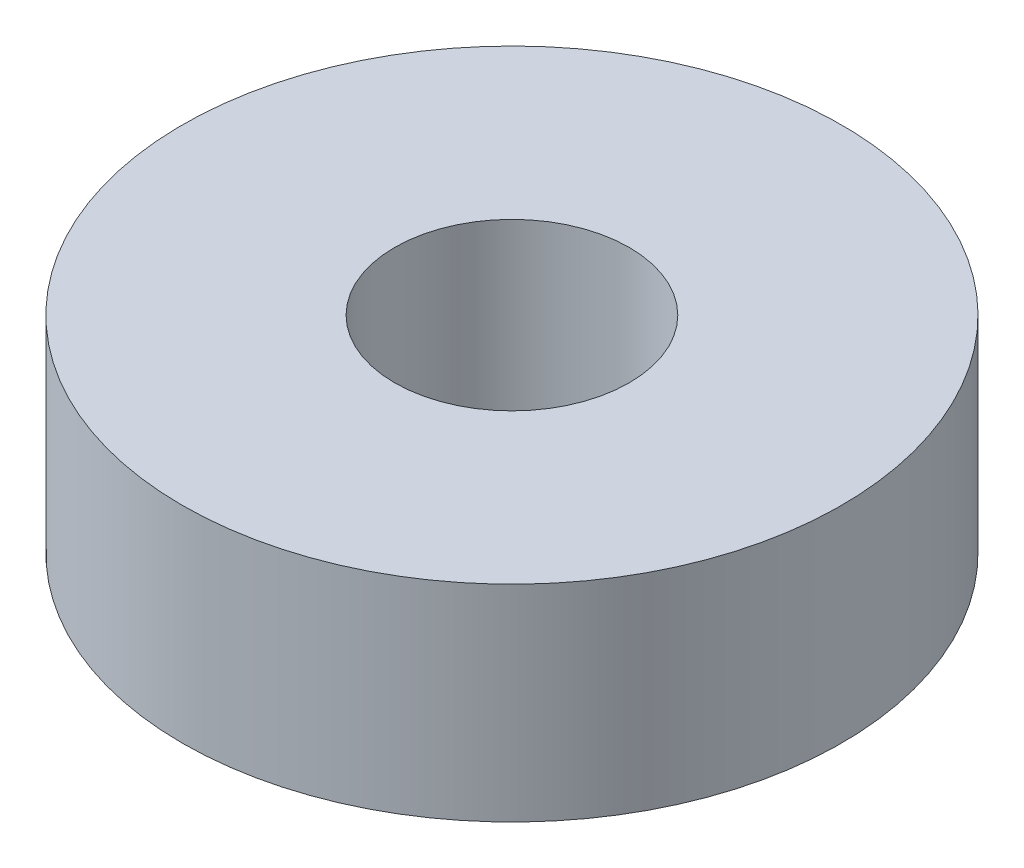
ISO-10303-21;
HEADER;
FILE_DESCRIPTION(('STEP AP214'),'2;1');
FILE_NAME('part.step','',(''),(''),'','','');
FILE_SCHEMA(('AUTOMOTIVE_DESIGN { 1 0 10303 214 1 1 1 1 }'));
ENDSEC;
DATA;
#1=APPLICATION_CONTEXT('core data for automotive mechanical design processes');
#2=APPLICATION_PROTOCOL_DEFINITION('international standard','automotive_design',2000,#1);
#3=PRODUCT_CONTEXT('',#1,'mechanical');
#4=PRODUCT('Part','Part','',(#3));
#5=PRODUCT_RELATED_PRODUCT_CATEGORY('part','',(#4));
#6=PRODUCT_DEFINITION_FORMATION('','',#4);
#7=PRODUCT_DEFINITION_CONTEXT('part definition',#1,'design');
#8=PRODUCT_DEFINITION('design','',#6,#7);
#9=PRODUCT_DEFINITION_SHAPE('','',#8);
#10=(LENGTH_UNIT() NAMED_UNIT(*) SI_UNIT(.MILLI.,.METRE.));
#11=(NAMED_UNIT(*) PLANE_ANGLE_UNIT() SI_UNIT($,.RADIAN.));
#12=(NAMED_UNIT(*) SI_UNIT($,.STERADIAN.) SOLID_ANGLE_UNIT());
#13=UNCERTAINTY_MEASURE_WITH_UNIT(LENGTH_MEASURE(1.E-05),#10,'distance_accuracy_value','');
#14=(GEOMETRIC_REPRESENTATION_CONTEXT(3) GLOBAL_UNCERTAINTY_ASSIGNED_CONTEXT((#13)) GLOBAL_UNIT_ASSIGNED_CONTEXT((#10,
#11,#12)) REPRESENTATION_CONTEXT('',''));
#15=CARTESIAN_POINT('',(0.,0.,0.));
#16=DIRECTION('',(0.,0.,1.));
#17=DIRECTION('',(1.,0.,0.));
#18=AXIS2_PLACEMENT_3D('',#15,#16,#17);
#19=CARTESIAN_POINT('',(0.,10.,0.));
#20=DIRECTION('',(0.,-1.,0.));
#21=DIRECTION('',(0.,0.,-1.));
#22=AXIS2_PLACEMENT_3D('',#19,#20,#21);
#23=CYLINDRICAL_SURFACE('',#22,16.);
#24=CARTESIAN_POINT('',(0.,10.,0.));
#25=DIRECTION('',(0.,1.,0.));
#26=DIRECTION('',(0.,0.,1.));
#27=AXIS2_PLACEMENT_3D('',#24,#25,#26);
#28=CIRCLE('',#27,16.);
#29=CARTESIAN_POINT('',(0.,10.,16.));
#30=VERTEX_POINT('',#29);
#31=EDGE_CURVE('E10',#30,#30,#28,.T.);
#32=ORIENTED_EDGE('',*,*,#31,.F.);
#33=EDGE_LOOP('',(#32));
#34=FACE_BOUND('',#33,.T.);
#35=CARTESIAN_POINT('',(0.,0.,0.));
#36=DIRECTION('',(0.,1.,0.));
#37=DIRECTION('',(0.,0.,1.));
#38=AXIS2_PLACEMENT_3D('',#35,#36,#37);
#39=CIRCLE('',#38,16.);
#40=CARTESIAN_POINT('',(0.,0.,16.));
#41=VERTEX_POINT('',#40);
#42=EDGE_CURVE('E34',#41,#41,#39,.T.);
#43=ORIENTED_EDGE('',*,*,#42,.T.);
#44=EDGE_LOOP('',(#43));
#45=FACE_BOUND('',#44,.T.);
#46=ADVANCED_FACE('F31',(#34,#45),#23,.T.);
#47=CARTESIAN_POINT('',(0.,10.,0.));
#48=DIRECTION('',(0.,1.,0.));
#49=DIRECTION('',(0.,0.,1.));
#50=AXIS2_PLACEMENT_3D('',#47,#48,#49);
#51=PLANE('',#50);
#52=CARTESIAN_POINT('',(0.,10.,0.));
#53=DIRECTION('',(0.,1.,0.));
#54=DIRECTION('',(0.,0.,1.));
#55=AXIS2_PLACEMENT_3D('',#52,#53,#54);
#56=CIRCLE('',#55,5.69460229021476);
#57=CARTESIAN_POINT('',(0.,10.,5.69460229021476));
#58=VERTEX_POINT('',#57);
#59=EDGE_CURVE('E43',#58,#58,#56,.T.);
#60=ORIENTED_EDGE('',*,*,#59,.F.);
#61=EDGE_LOOP('',(#60));
#62=FACE_BOUND('',#61,.T.);
#63=ORIENTED_EDGE('',*,*,#31,.T.);
#64=EDGE_LOOP('',(#63));
#65=FACE_BOUND('',#64,.T.);
#66=ADVANCED_FACE('F58',(#62,#65),#51,.T.);
#67=CARTESIAN_POINT('',(0.,0.,0.));
#68=DIRECTION('',(0.,1.,0.));
#69=DIRECTION('',(0.,0.,1.));
#70=AXIS2_PLACEMENT_3D('',#67,#68,#69);
#71=PLANE('',#70);
#72=CARTESIAN_POINT('',(0.,0.,0.));
#73=DIRECTION('',(0.,1.,0.));
#74=DIRECTION('',(0.,0.,1.));
#75=AXIS2_PLACEMENT_3D('',#72,#73,#74);
#76=CIRCLE('',#75,5.69460229021476);
#77=CARTESIAN_POINT('',(0.,0.,5.69460229021476));
#78=VERTEX_POINT('',#77);
#79=EDGE_CURVE('E41',#78,#78,#76,.T.);
#80=ORIENTED_EDGE('',*,*,#79,.T.);
#81=EDGE_LOOP('',(#80));
#82=FACE_BOUND('',#81,.T.);
#83=ORIENTED_EDGE('',*,*,#42,.F.);
#84=EDGE_LOOP('',(#83));
#85=FACE_BOUND('',#84,.T.);
#86=ADVANCED_FACE('F49',(#82,#85),#71,.F.);
#87=CARTESIAN_POINT('',(0.,0.,0.));
#88=DIRECTION('',(0.,1.,0.));
#89=DIRECTION('',(0.,0.,1.));
#90=AXIS2_PLACEMENT_3D('',#87,#88,#89);
#91=CYLINDRICAL_SURFACE('',#90,5.69460229021476);
#92=ORIENTED_EDGE('',*,*,#79,.F.);
#93=EDGE_LOOP('',(#92));
#94=FACE_BOUND('',#93,.T.);
#95=ORIENTED_EDGE('',*,*,#59,.T.);
#96=EDGE_LOOP('',(#95));
#97=FACE_BOUND('',#96,.T.);
#98=ADVANCED_FACE('F52',(#94,#97),#91,.F.);
#99=CLOSED_SHELL('',(#46,#66,#86,#98));
#100=MANIFOLD_SOLID_BREP('B2',#99);
#101=ADVANCED_BREP_SHAPE_REPRESENTATION('',(#18,#100),#14);
#102=SHAPE_DEFINITION_REPRESENTATION(#9,#101);
ENDSEC;
END-ISO-10303-21;
